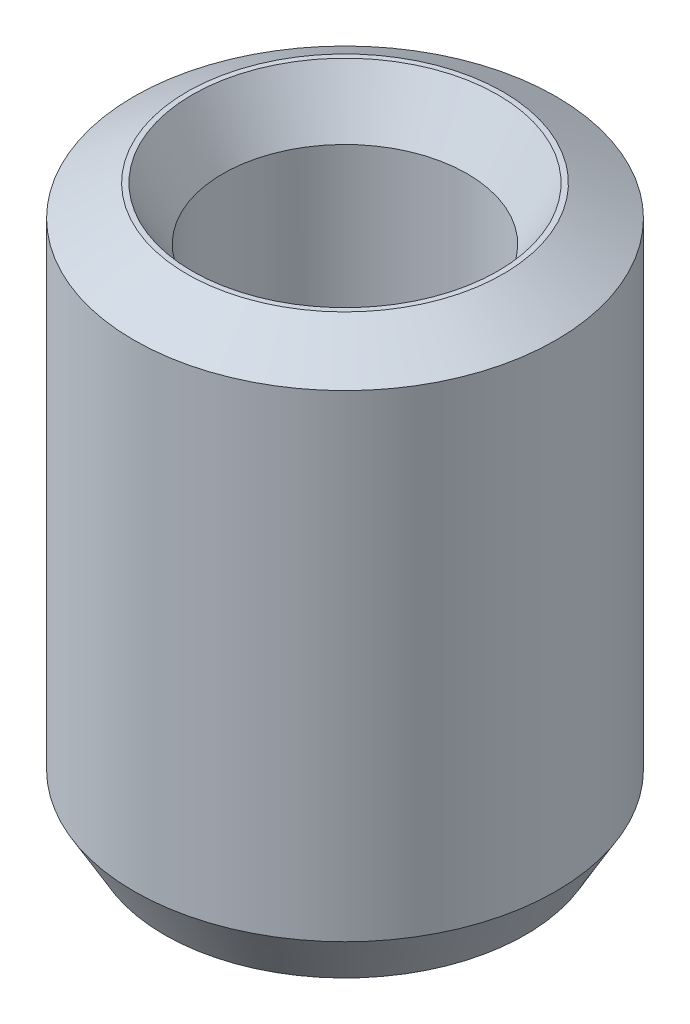
ISO-10303-21;
HEADER;
FILE_DESCRIPTION(('STEP AP214'),'2;1');
FILE_NAME('part.step','',(''),(''),'','','');
FILE_SCHEMA(('AUTOMOTIVE_DESIGN { 1 0 10303 214 1 1 1 1 }'));
ENDSEC;
DATA;
#1=APPLICATION_CONTEXT('core data for automotive mechanical design processes');
#2=APPLICATION_PROTOCOL_DEFINITION('international standard','automotive_design',2000,#1);
#3=PRODUCT_CONTEXT('',#1,'mechanical');
#4=PRODUCT('Part','Part','',(#3));
#5=PRODUCT_RELATED_PRODUCT_CATEGORY('part','',(#4));
#6=PRODUCT_DEFINITION_FORMATION('','',#4);
#7=PRODUCT_DEFINITION_CONTEXT('part definition',#1,'design');
#8=PRODUCT_DEFINITION('design','',#6,#7);
#9=PRODUCT_DEFINITION_SHAPE('','',#8);
#10=(LENGTH_UNIT() NAMED_UNIT(*) SI_UNIT(.MILLI.,.METRE.));
#11=(NAMED_UNIT(*) PLANE_ANGLE_UNIT() SI_UNIT($,.RADIAN.));
#12=(NAMED_UNIT(*) SI_UNIT($,.STERADIAN.) SOLID_ANGLE_UNIT());
#13=UNCERTAINTY_MEASURE_WITH_UNIT(LENGTH_MEASURE(1.E-05),#10,'distance_accuracy_value','');
#14=(GEOMETRIC_REPRESENTATION_CONTEXT(3) GLOBAL_UNCERTAINTY_ASSIGNED_CONTEXT((#13)) GLOBAL_UNIT_ASSIGNED_CONTEXT((#10,
#11,#12)) REPRESENTATION_CONTEXT('',''));
#15=CARTESIAN_POINT('',(0.,0.,0.));
#16=DIRECTION('',(0.,0.,1.));
#17=DIRECTION('',(1.,0.,0.));
#18=AXIS2_PLACEMENT_3D('',#15,#16,#17);
#19=CARTESIAN_POINT('',(0.,59.8108777179771,0.));
#20=DIRECTION('',(0.,-1.,0.));
#21=DIRECTION('',(0.,0.,-1.));
#22=AXIS2_PLACEMENT_3D('',#19,#20,#21);
#23=CYLINDRICAL_SURFACE('',#22,22.5);
#24=CARTESIAN_POINT('',(0.,5.65658224908677,0.));
#25=DIRECTION('',(0.,1.,0.));
#26=DIRECTION('',(0.,0.,1.));
#27=AXIS2_PLACEMENT_3D('',#24,#25,#26);
#28=CIRCLE('',#27,22.5);
#29=CARTESIAN_POINT('',(0.,5.65658224908676,-22.5));
#30=VERTEX_POINT('',#29);
#31=EDGE_CURVE('E10',#30,#30,#28,.T.);
#32=CARTESIAN_POINT('',(0.,56.5450484337736,0.));
#33=DIRECTION('',(0.,1.,0.));
#34=DIRECTION('',(0.,0.,1.));
#35=AXIS2_PLACEMENT_3D('',#32,#33,#34);
#36=CIRCLE('',#35,22.5);
#37=CARTESIAN_POINT('',(0.,56.5450484337736,-22.5));
#38=VERTEX_POINT('',#37);
#39=EDGE_CURVE('E50',#38,#38,#36,.F.);
#40=CARTESIAN_POINT('',(0.,5.65658224908676,-22.5));
#41=CARTESIAN_POINT('',(0.,6.18667043851058,-22.5));
#42=CARTESIAN_POINT('',(0.,6.7167586279344,-22.5));
#43=CARTESIAN_POINT('',(0.,7.77693500678205,-22.5));
#44=CARTESIAN_POINT('',(0.,8.30702319620587,-22.5));
#45=CARTESIAN_POINT('',(0.,9.36719957505351,-22.5));
#46=CARTESIAN_POINT('',(0.,9.89728776447733,-22.5));
#47=CARTESIAN_POINT('',(0.,10.957464143325,-22.5));
#48=CARTESIAN_POINT('',(0.,11.4875523327488,-22.5));
#49=CARTESIAN_POINT('',(0.,12.5477287115964,-22.5));
#50=CARTESIAN_POINT('',(0.,13.0778169010203,-22.5));
#51=CARTESIAN_POINT('',(0.,14.1379932798679,-22.5));
#52=CARTESIAN_POINT('',(0.,14.6680814692917,-22.5));
#53=CARTESIAN_POINT('',(0.,15.7282578481394,-22.5));
#54=CARTESIAN_POINT('',(0.,16.2583460375632,-22.5));
#55=CARTESIAN_POINT('',(0.,17.3185224164108,-22.5));
#56=CARTESIAN_POINT('',(0.,17.8486106058347,-22.5));
#57=CARTESIAN_POINT('',(0.,18.9087869846823,-22.5));
#58=CARTESIAN_POINT('',(0.,19.4388751741061,-22.5));
#59=CARTESIAN_POINT('',(0.,20.4990515529538,-22.5));
#60=CARTESIAN_POINT('',(0.,21.0291397423776,-22.5));
#61=CARTESIAN_POINT('',(0.,22.0893161212252,-22.5));
#62=CARTESIAN_POINT('',(0.,22.619404310649,-22.5));
#63=CARTESIAN_POINT('',(0.,23.6795806894967,-22.5));
#64=CARTESIAN_POINT('',(0.,24.2096688789205,-22.5));
#65=CARTESIAN_POINT('',(0.,25.2698452577682,-22.5));
#66=CARTESIAN_POINT('',(0.,25.799933447192,-22.5));
#67=CARTESIAN_POINT('',(0.,26.8601098260396,-22.5));
#68=CARTESIAN_POINT('',(0.,27.3901980154634,-22.5));
#69=CARTESIAN_POINT('',(0.,28.4503743943111,-22.5));
#70=CARTESIAN_POINT('',(0.,28.9804625837349,-22.5));
#71=CARTESIAN_POINT('',(0.,30.0406389625825,-22.5));
#72=CARTESIAN_POINT('',(0.,30.5707271520064,-22.5));
#73=CARTESIAN_POINT('',(0.,31.630903530854,-22.5));
#74=CARTESIAN_POINT('',(0.,32.1609917202778,-22.5));
#75=CARTESIAN_POINT('',(0.,33.2211680991255,-22.5));
#76=CARTESIAN_POINT('',(0.,33.7512562885493,-22.5));
#77=CARTESIAN_POINT('',(0.,34.8114326673969,-22.5));
#78=CARTESIAN_POINT('',(0.,35.3415208568208,-22.5));
#79=CARTESIAN_POINT('',(0.,36.4016972356684,-22.5));
#80=CARTESIAN_POINT('',(0.,36.9317854250922,-22.5));
#81=CARTESIAN_POINT('',(0.,37.9919618039399,-22.5));
#82=CARTESIAN_POINT('',(0.,38.5220499933637,-22.5));
#83=CARTESIAN_POINT('',(0.,39.5822263722113,-22.5));
#84=CARTESIAN_POINT('',(0.,40.1123145616352,-22.5));
#85=CARTESIAN_POINT('',(0.,41.1724909404828,-22.5));
#86=CARTESIAN_POINT('',(0.,41.7025791299066,-22.5));
#87=CARTESIAN_POINT('',(0.,42.7627555087543,-22.5));
#88=CARTESIAN_POINT('',(0.,43.2928436981781,-22.5));
#89=CARTESIAN_POINT('',(0.,44.3530200770257,-22.5));
#90=CARTESIAN_POINT('',(0.,44.8831082664495,-22.5));
#91=CARTESIAN_POINT('',(0.,45.9432846452972,-22.5));
#92=CARTESIAN_POINT('',(0.,46.473372834721,-22.5));
#93=CARTESIAN_POINT('',(0.,47.5335492135687,-22.5));
#94=CARTESIAN_POINT('',(0.,48.0636374029925,-22.5));
#95=CARTESIAN_POINT('',(0.,49.1238137818401,-22.5));
#96=CARTESIAN_POINT('',(0.,49.6539019712639,-22.5));
#97=CARTESIAN_POINT('',(0.,50.7140783501116,-22.5));
#98=CARTESIAN_POINT('',(0.,51.2441665395354,-22.5));
#99=CARTESIAN_POINT('',(0.,52.304342918383,-22.5));
#100=CARTESIAN_POINT('',(0.,52.8344311078069,-22.5));
#101=CARTESIAN_POINT('',(0.,53.8946074866545,-22.5));
#102=CARTESIAN_POINT('',(0.,54.4246956760783,-22.5));
#103=CARTESIAN_POINT('',(0.,55.484872054926,-22.5));
#104=CARTESIAN_POINT('',(0.,56.0149602443498,-22.5));
#105=CARTESIAN_POINT('',(0.,56.5450484337736,-22.5));
#106=B_SPLINE_CURVE_WITH_KNOTS('',3,(#40,#41,#42,#43,#44,#45,#46,#47,#48,#49,#50,#51,#52,#53,
#54,#55,#56,#57,#58,#59,#60,#61,#62,#63,#64,#65,#66,#67,#68,#69,#70,#71,#72,#73,#74,#75,#76,#77,
#78,#79,#80,#81,#82,#83,#84,#85,#86,#87,#88,#89,#90,#91,#92,#93,#94,#95,#96,#97,#98,#99,#100,
#101,#102,#103,#104,#105),.UNSPECIFIED.,.F.,.F.,(4,2,2,2,2,2,2,2,2,2,2,2,2,2,2,2,2,2,2,2,2,2,2,
2,2,2,2,2,2,2,2,2,4),(0.,1.59026456827147,3.18052913654293,4.7707937048144,6.36105827308586,
7.95132284135733,9.54158740962879,11.1318519779003,12.7221165461717,14.3123811144432,
15.9026456827146,17.4929102509861,19.0831748192576,20.673439387529,22.2637039558005,
23.853968524072,25.4442330923434,27.0344976606149,28.6247622288864,30.2150267971578,
31.8052913654293,33.3955559337007,34.9858205019722,36.5760850702437,38.1663496385151,
39.7566142067866,41.3468787750581,42.9371433433295,44.527407911601,46.1176724798725,
47.7079370481439,49.2982016164154,50.8884661846869),.UNSPECIFIED.);
#107=EDGE_CURVE('BSEAM39',#30,#38,#106,.T.);
#108=ORIENTED_EDGE('',*,*,#31,.T.);
#109=ORIENTED_EDGE('',*,*,#39,.T.);
#110=ORIENTED_EDGE('',*,*,#107,.T.);
#111=ORIENTED_EDGE('',*,*,#107,.F.);
#112=EDGE_LOOP('',(#108,#110,#109,#111));
#113=FACE_BOUND('',#112,.T.);
#114=ADVANCED_FACE('F39',(#113),#23,.T.);
#115=CARTESIAN_POINT('',(0.,59.8108777179771,0.));
#116=DIRECTION('',(0.,1.,0.));
#117=DIRECTION('',(0.,0.,1.));
#118=AXIS2_PLACEMENT_3D('',#115,#116,#117);
#119=PLANE('',#118);
#120=CARTESIAN_POINT('',(0.,59.8108777179771,0.));
#121=DIRECTION('',(0.,1.,0.));
#122=DIRECTION('',(0.,0.,1.));
#123=AXIS2_PLACEMENT_3D('',#120,#121,#122);
#124=CIRCLE('',#123,16.290261178427);
#125=CARTESIAN_POINT('',(0.,59.8108777179771,16.290261178427));
#126=VERTEX_POINT('',#125);
#127=EDGE_CURVE('E58',#126,#126,#124,.F.);
#128=ORIENTED_EDGE('',*,*,#127,.T.);
#129=EDGE_LOOP('',(#128));
#130=FACE_BOUND('',#129,.T.);
#131=CARTESIAN_POINT('',(0.,59.8108777179771,0.));
#132=DIRECTION('',(0.,1.,0.));
#133=DIRECTION('',(0.,0.,1.));
#134=AXIS2_PLACEMENT_3D('',#131,#132,#133);
#135=CIRCLE('',#134,16.8434177509134);
#136=CARTESIAN_POINT('',(0.,59.810877717977,-16.8434177509134));
#137=VERTEX_POINT('',#136);
#138=EDGE_CURVE('E61',#137,#137,#135,.T.);
#139=ORIENTED_EDGE('',*,*,#138,.T.);
#140=EDGE_LOOP('',(#139));
#141=FACE_BOUND('',#140,.T.);
#142=ADVANCED_FACE('F88',(#130,#141),#119,.T.);
#143=CARTESIAN_POINT('',(0.,0.,0.));
#144=DIRECTION('',(0.,1.,0.));
#145=DIRECTION('',(0.,0.,1.));
#146=AXIS2_PLACEMENT_3D('',#143,#144,#145);
#147=PLANE('',#146);
#148=CARTESIAN_POINT('',(0.,0.,0.));
#149=DIRECTION('',(0.,1.,0.));
#150=DIRECTION('',(0.,0.,1.));
#151=AXIS2_PLACEMENT_3D('',#148,#149,#150);
#152=CIRCLE('',#151,18.6810141433101);
#153=CARTESIAN_POINT('',(0.,0.,18.6810141433101));
#154=VERTEX_POINT('',#153);
#155=EDGE_CURVE('E51',#154,#154,#152,.T.);
#156=ORIENTED_EDGE('',*,*,#155,.T.);
#157=EDGE_LOOP('',(#156));
#158=FACE_BOUND('',#157,.T.);
#159=CARTESIAN_POINT('',(0.,0.,0.));
#160=DIRECTION('',(0.,1.,0.));
#161=DIRECTION('',(0.,0.,1.));
#162=AXIS2_PLACEMENT_3D('',#159,#160,#161);
#163=CIRCLE('',#162,19.2341707157965);
#164=CARTESIAN_POINT('',(0.,0.,19.2341707157965));
#165=VERTEX_POINT('',#164);
#166=EDGE_CURVE('E54',#165,#165,#163,.F.);
#167=ORIENTED_EDGE('',*,*,#166,.T.);
#168=EDGE_LOOP('',(#167));
#169=FACE_BOUND('',#168,.T.);
#170=ADVANCED_FACE('F83',(#158,#169),#147,.F.);
#171=CARTESIAN_POINT('',(0.,59.8108777179771,0.));
#172=DIRECTION('',(0.,-1.,0.));
#173=DIRECTION('',(0.,0.,-1.));
#174=AXIS2_PLACEMENT_3D('',#171,#172,#173);
#175=CYLINDRICAL_SURFACE('',#174,13.0244318942235);
#176=CARTESIAN_POINT('',(0.,54.1542954688903,0.));
#177=DIRECTION('',(0.,1.,0.));
#178=DIRECTION('',(0.,0.,1.));
#179=AXIS2_PLACEMENT_3D('',#176,#177,#178);
#180=CIRCLE('',#179,13.0244318942235);
#181=CARTESIAN_POINT('',(0.,54.1542954688903,-13.0244318942235));
#182=VERTEX_POINT('',#181);
#183=EDGE_CURVE('E67',#182,#182,#180,.T.);
#184=CARTESIAN_POINT('',(0.,3.26582928420344,0.));
#185=DIRECTION('',(0.,1.,0.));
#186=DIRECTION('',(0.,0.,1.));
#187=AXIS2_PLACEMENT_3D('',#184,#185,#186);
#188=CIRCLE('',#187,13.0244318942235);
#189=CARTESIAN_POINT('',(0.,3.26582928420344,-13.0244318942235));
#190=VERTEX_POINT('',#189);
#191=EDGE_CURVE('E69',#190,#190,#188,.F.);
#192=CARTESIAN_POINT('',(0.,54.1542954688903,-13.0244318942235));
#193=CARTESIAN_POINT('',(0.,53.6242072794665,-13.0244318942235));
#194=CARTESIAN_POINT('',(0.,53.0941190900427,-13.0244318942235));
#195=CARTESIAN_POINT('',(0.,52.033942711195,-13.0244318942235));
#196=CARTESIAN_POINT('',(0.,51.5038545217712,-13.0244318942235));
#197=CARTESIAN_POINT('',(0.,50.4436781429236,-13.0244318942235));
#198=CARTESIAN_POINT('',(0.,49.9135899534997,-13.0244318942235));
#199=CARTESIAN_POINT('',(0.,48.8534135746521,-13.0244318942235));
#200=CARTESIAN_POINT('',(0.,48.3233253852283,-13.0244318942235));
#201=CARTESIAN_POINT('',(0.,47.2631490063806,-13.0244318942235));
#202=CARTESIAN_POINT('',(0.,46.7330608169568,-13.0244318942235));
#203=CARTESIAN_POINT('',(0.,45.6728844381092,-13.0244318942235));
#204=CARTESIAN_POINT('',(0.,45.1427962486853,-13.0244318942235));
#205=CARTESIAN_POINT('',(0.,44.0826198698377,-13.0244318942235));
#206=CARTESIAN_POINT('',(0.,43.5525316804139,-13.0244318942235));
#207=CARTESIAN_POINT('',(0.,42.4923553015662,-13.0244318942235));
#208=CARTESIAN_POINT('',(0.,41.9622671121424,-13.0244318942235));
#209=CARTESIAN_POINT('',(0.,40.9020907332948,-13.0244318942235));
#210=CARTESIAN_POINT('',(0.,40.3720025438709,-13.0244318942235));
#211=CARTESIAN_POINT('',(0.,39.3118261650233,-13.0244318942235));
#212=CARTESIAN_POINT('',(0.,38.7817379755995,-13.0244318942235));
#213=CARTESIAN_POINT('',(0.,37.7215615967518,-13.0244318942235));
#214=CARTESIAN_POINT('',(0.,37.191473407328,-13.0244318942235));
#215=CARTESIAN_POINT('',(0.,36.1312970284804,-13.0244318942235));
#216=CARTESIAN_POINT('',(0.,35.6012088390566,-13.0244318942235));
#217=CARTESIAN_POINT('',(0.,34.5410324602089,-13.0244318942235));
#218=CARTESIAN_POINT('',(0.,34.0109442707851,-13.0244318942235));
#219=CARTESIAN_POINT('',(0.,32.9507678919374,-13.0244318942235));
#220=CARTESIAN_POINT('',(0.,32.4206797025136,-13.0244318942235));
#221=CARTESIAN_POINT('',(0.,31.360503323666,-13.0244318942235));
#222=CARTESIAN_POINT('',(0.,30.8304151342422,-13.0244318942235));
#223=CARTESIAN_POINT('',(0.,29.7702387553945,-13.0244318942235));
#224=CARTESIAN_POINT('',(0.,29.2401505659707,-13.0244318942235));
#225=CARTESIAN_POINT('',(0.,28.179974187123,-13.0244318942235));
#226=CARTESIAN_POINT('',(0.,27.6498859976992,-13.0244318942235));
#227=CARTESIAN_POINT('',(0.,26.5897096188516,-13.0244318942235));
#228=CARTESIAN_POINT('',(0.,26.0596214294278,-13.0244318942235));
#229=CARTESIAN_POINT('',(0.,24.9994450505801,-13.0244318942235));
#230=CARTESIAN_POINT('',(0.,24.4693568611563,-13.0244318942235));
#231=CARTESIAN_POINT('',(0.,23.4091804823087,-13.0244318942235));
#232=CARTESIAN_POINT('',(0.,22.8790922928848,-13.0244318942235));
#233=CARTESIAN_POINT('',(0.,21.8189159140372,-13.0244318942235));
#234=CARTESIAN_POINT('',(0.,21.2888277246134,-13.0244318942235));
#235=CARTESIAN_POINT('',(0.,20.2286513457657,-13.0244318942235));
#236=CARTESIAN_POINT('',(0.,19.6985631563419,-13.0244318942235));
#237=CARTESIAN_POINT('',(0.,18.6383867774943,-13.0244318942235));
#238=CARTESIAN_POINT('',(0.,18.1082985880704,-13.0244318942235));
#239=CARTESIAN_POINT('',(0.,17.0481222092228,-13.0244318942235));
#240=CARTESIAN_POINT('',(0.,16.518034019799,-13.0244318942235));
#241=CARTESIAN_POINT('',(0.,15.4578576409513,-13.0244318942235));
#242=CARTESIAN_POINT('',(0.,14.9277694515275,-13.0244318942235));
#243=CARTESIAN_POINT('',(0.,13.8675930726799,-13.0244318942235));
#244=CARTESIAN_POINT('',(0.,13.337504883256,-13.0244318942235));
#245=CARTESIAN_POINT('',(0.,12.2773285044084,-13.0244318942235));
#246=CARTESIAN_POINT('',(0.,11.7472403149846,-13.0244318942235));
#247=CARTESIAN_POINT('',(0.,10.6870639361369,-13.0244318942235));
#248=CARTESIAN_POINT('',(0.,10.1569757467131,-13.0244318942235));
#249=CARTESIAN_POINT('',(0.,9.09679936786548,-13.0244318942235));
#250=CARTESIAN_POINT('',(0.,8.56671117844165,-13.0244318942235));
#251=CARTESIAN_POINT('',(0.,7.50653479959401,-13.0244318942235));
#252=CARTESIAN_POINT('',(0.,6.97644661017019,-13.0244318942235));
#253=CARTESIAN_POINT('',(0.,5.91627023132255,-13.0244318942235));
#254=CARTESIAN_POINT('',(0.,5.38618204189872,-13.0244318942235));
#255=CARTESIAN_POINT('',(0.,4.32600566305108,-13.0244318942235));
#256=CARTESIAN_POINT('',(0.,3.79591747362726,-13.0244318942235));
#257=CARTESIAN_POINT('',(0.,3.26582928420344,-13.0244318942235));
#258=B_SPLINE_CURVE_WITH_KNOTS('',3,(#192,#193,#194,#195,#196,#197,#198,#199,#200,#201,#202,
#203,#204,#205,#206,#207,#208,#209,#210,#211,#212,#213,#214,#215,#216,#217,#218,#219,#220,#221,
#222,#223,#224,#225,#226,#227,#228,#229,#230,#231,#232,#233,#234,#235,#236,#237,#238,#239,#240,
#241,#242,#243,#244,#245,#246,#247,#248,#249,#250,#251,#252,#253,#254,#255,#256,#257),
.UNSPECIFIED.,.F.,.F.,(4,2,2,2,2,2,2,2,2,2,2,2,2,2,2,2,2,2,2,2,2,2,2,2,2,2,2,2,2,2,2,2,4),(0.,
1.59026456827146,3.18052913654292,4.77079370481439,6.36105827308586,7.95132284135732,
9.54158740962879,11.1318519779003,12.7221165461717,14.3123811144432,15.9026456827146,
17.4929102509861,19.0831748192576,20.673439387529,22.2637039558005,23.853968524072,
25.4442330923434,27.0344976606149,28.6247622288864,30.2150267971578,31.8052913654293,
33.3955559337007,34.9858205019722,36.5760850702437,38.1663496385151,39.7566142067866,
41.3468787750581,42.9371433433295,44.527407911601,46.1176724798725,47.7079370481439,
49.2982016164154,50.8884661846869),.UNSPECIFIED.);
#259=EDGE_CURVE('BSEAM71',#182,#190,#258,.T.);
#260=ORIENTED_EDGE('',*,*,#183,.T.);
#261=ORIENTED_EDGE('',*,*,#191,.T.);
#262=ORIENTED_EDGE('',*,*,#259,.T.);
#263=ORIENTED_EDGE('',*,*,#259,.F.);
#264=EDGE_LOOP('',(#260,#262,#261,#263));
#265=FACE_BOUND('',#264,.T.);
#266=ADVANCED_FACE('F71',(#265),#175,.F.);
#267=CARTESIAN_POINT('',(0.,54.1542954688903,0.));
#268=DIRECTION('',(0.,1.,0.));
#269=DIRECTION('',(0.,0.,1.));
#270=AXIS2_PLACEMENT_3D('',#267,#268,#269);
#271=CONICAL_SURFACE('',#270,13.0244318942235,0.523598775598302);
#272=ORIENTED_EDGE('',*,*,#127,.F.);
#273=EDGE_LOOP('',(#272));
#274=FACE_BOUND('',#273,.T.);
#275=ORIENTED_EDGE('',*,*,#183,.F.);
#276=EDGE_LOOP('',(#275));
#277=FACE_BOUND('',#276,.T.);
#278=ADVANCED_FACE('F77',(#274,#277),#271,.F.);
#279=CARTESIAN_POINT('',(0.,0.,0.));
#280=DIRECTION('',(0.,-1.,0.));
#281=DIRECTION('',(0.,0.,-1.));
#282=AXIS2_PLACEMENT_3D('',#279,#280,#281);
#283=CONICAL_SURFACE('',#282,18.6810141433101,1.04719755119659);
#284=ORIENTED_EDGE('',*,*,#191,.F.);
#285=EDGE_LOOP('',(#284));
#286=FACE_BOUND('',#285,.T.);
#287=ORIENTED_EDGE('',*,*,#155,.F.);
#288=EDGE_LOOP('',(#287));
#289=FACE_BOUND('',#288,.T.);
#290=ADVANCED_FACE('F73',(#286,#289),#283,.F.);
#291=CARTESIAN_POINT('',(0.,5.65658224908677,0.));
#292=DIRECTION('',(0.,1.,0.));
#293=DIRECTION('',(0.,0.,1.));
#294=AXIS2_PLACEMENT_3D('',#291,#292,#293);
#295=CONICAL_SURFACE('',#294,22.5,0.523598775598303);
#296=ORIENTED_EDGE('',*,*,#166,.F.);
#297=EDGE_LOOP('',(#296));
#298=FACE_BOUND('',#297,.T.);
#299=ORIENTED_EDGE('',*,*,#31,.F.);
#300=EDGE_LOOP('',(#299));
#301=FACE_BOUND('',#300,.T.);
#302=ADVANCED_FACE('F76',(#298,#301),#295,.T.);
#303=CARTESIAN_POINT('',(0.,59.8108777179771,0.));
#304=DIRECTION('',(0.,-1.,0.));
#305=DIRECTION('',(0.,0.,-1.));
#306=AXIS2_PLACEMENT_3D('',#303,#304,#305);
#307=CONICAL_SURFACE('',#306,16.8434177509134,1.04719755119659);
#308=CARTESIAN_POINT('',(0.,56.5450484337736,-22.5));
#309=CARTESIAN_POINT('',(0.,56.5790674888174,-22.4410772682387));
#310=CARTESIAN_POINT('',(0.,56.6130865438612,-22.3821545364774));
#311=CARTESIAN_POINT('',(0.,56.6811246539488,-22.2643090729547));
#312=CARTESIAN_POINT('',(0.,56.7151437089926,-22.2053863411934));
#313=CARTESIAN_POINT('',(0.,56.7831818190801,-22.0875408776708));
#314=CARTESIAN_POINT('',(0.,56.8172008741239,-22.0286181459095));
#315=CARTESIAN_POINT('',(0.,56.8852389842115,-21.9107726823868));
#316=CARTESIAN_POINT('',(0.,56.9192580392553,-21.8518499506255));
#317=CARTESIAN_POINT('',(0.,56.9872961493428,-21.7340044871029));
#318=CARTESIAN_POINT('',(0.,57.0213152043866,-21.6750817553415));
#319=CARTESIAN_POINT('',(0.,57.0893533144742,-21.5572362918189));
#320=CARTESIAN_POINT('',(0.,57.123372369518,-21.4983135600576));
#321=CARTESIAN_POINT('',(0.,57.1914104796056,-21.380468096535));
#322=CARTESIAN_POINT('',(0.,57.2254295346493,-21.3215453647736));
#323=CARTESIAN_POINT('',(0.,57.2934676447369,-21.203699901251));
#324=CARTESIAN_POINT('',(0.,57.3274866997807,-21.1447771694897));
#325=CARTESIAN_POINT('',(0.,57.3955248098683,-21.026931705967));
#326=CARTESIAN_POINT('',(0.,57.429543864912,-20.9680089742057));
#327=CARTESIAN_POINT('',(0.,57.4975819749996,-20.8501635106831));
#328=CARTESIAN_POINT('',(0.,57.5316010300434,-20.7912407789218));
#329=CARTESIAN_POINT('',(0.,57.599639140131,-20.6733953153991));
#330=CARTESIAN_POINT('',(0.,57.6336581951748,-20.6144725836378));
#331=CARTESIAN_POINT('',(0.,57.7016963052623,-20.4966271201152));
#332=CARTESIAN_POINT('',(0.,57.7357153603061,-20.4377043883539));
#333=CARTESIAN_POINT('',(0.,57.8037534703937,-20.3198589248312));
#334=CARTESIAN_POINT('',(0.,57.8377725254375,-20.2609361930699));
#335=CARTESIAN_POINT('',(0.,57.9058106355251,-20.1430907295473));
#336=CARTESIAN_POINT('',(0.,57.9398296905688,-20.0841679977859));
#337=CARTESIAN_POINT('',(0.,58.0078678006564,-19.9663225342633));
#338=CARTESIAN_POINT('',(0.,58.0418868557002,-19.907399802502));
#339=CARTESIAN_POINT('',(0.,58.1099249657878,-19.7895543389794));
#340=CARTESIAN_POINT('',(0.,58.1439440208316,-19.730631607218));
#341=CARTESIAN_POINT('',(0.,58.2119821309191,-19.6127861436954));
#342=CARTESIAN_POINT('',(0.,58.2460011859629,-19.5538634119341));
#343=CARTESIAN_POINT('',(0.,58.3140392960505,-19.4360179484114));
#344=CARTESIAN_POINT('',(0.,58.3480583510943,-19.3770952166501));
#345=CARTESIAN_POINT('',(0.,58.4160964611818,-19.2592497531275));
#346=CARTESIAN_POINT('',(0.,58.4501155162256,-19.2003270213662));
#347=CARTESIAN_POINT('',(0.,58.5181536263132,-19.0824815578435));
#348=CARTESIAN_POINT('',(0.,58.552172681357,-19.0235588260822));
#349=CARTESIAN_POINT('',(0.,58.6202107914446,-18.9057133625596));
#350=CARTESIAN_POINT('',(0.,58.6542298464883,-18.8467906307983));
#351=CARTESIAN_POINT('',(0.,58.7222679565759,-18.7289451672756));
#352=CARTESIAN_POINT('',(0.,58.7562870116197,-18.6700224355143));
#353=CARTESIAN_POINT('',(0.,58.8243251217073,-18.5521769719917));
#354=CARTESIAN_POINT('',(0.,58.8583441767511,-18.4932542402303));
#355=CARTESIAN_POINT('',(0.,58.9263822868386,-18.3754087767077));
#356=CARTESIAN_POINT('',(0.,58.9604013418824,-18.3164860449464));
#357=CARTESIAN_POINT('',(0.,59.02843945197,-18.1986405814237));
#358=CARTESIAN_POINT('',(0.,59.0624585070138,-18.1397178496624));
#359=CARTESIAN_POINT('',(0.,59.1304966171013,-18.0218723861398));
#360=CARTESIAN_POINT('',(0.,59.1645156721451,-17.9629496543785));
#361=CARTESIAN_POINT('',(0.,59.2325537822327,-17.8451041908558));
#362=CARTESIAN_POINT('',(0.,59.2665728372765,-17.7861814590945));
#363=CARTESIAN_POINT('',(0.,59.334610947364,-17.6683359955719));
#364=CARTESIAN_POINT('',(0.,59.3686300024078,-17.6094132638106));
#365=CARTESIAN_POINT('',(0.,59.4366681124954,-17.4915678002879));
#366=CARTESIAN_POINT('',(0.,59.4706871675392,-17.4326450685266));
#367=CARTESIAN_POINT('',(0.,59.5387252776268,-17.314799605004));
#368=CARTESIAN_POINT('',(0.,59.5727443326706,-17.2558768732426));
#369=CARTESIAN_POINT('',(0.,59.6407824427581,-17.13803140972));
#370=CARTESIAN_POINT('',(0.,59.6748014978019,-17.0791086779587));
#371=CARTESIAN_POINT('',(0.,59.7428396078895,-16.9612632144361));
#372=CARTESIAN_POINT('',(0.,59.7768586629333,-16.9023404826747));
#373=CARTESIAN_POINT('',(0.,59.8108777179771,-16.8434177509134));
#374=B_SPLINE_CURVE_WITH_KNOTS('',3,(#308,#309,#310,#311,#312,#313,#314,#315,#316,#317,#318,
#319,#320,#321,#322,#323,#324,#325,#326,#327,#328,#329,#330,#331,#332,#333,#334,#335,#336,#337,
#338,#339,#340,#341,#342,#343,#344,#345,#346,#347,#348,#349,#350,#351,#352,#353,#354,#355,#356,
#357,#358,#359,#360,#361,#362,#363,#364,#365,#366,#367,#368,#369,#370,#371,#372,#373),
.UNSPECIFIED.,.F.,.F.,(4,2,2,2,2,2,2,2,2,2,2,2,2,2,2,2,2,2,2,2,2,2,2,2,2,2,2,2,2,2,2,2,4),(0.,
0.204114330262716,0.408228660525426,0.612342990788139,0.816457321050851,1.02057165131357,
1.22468598157628,1.42880031183899,1.63291464210171,1.83702897236442,2.04114330262713,
2.24525763288985,2.44937196315256,2.65348629341527,2.85760062367798,3.0617149539407,
3.26582928420341,3.46994361446612,3.67405794472884,3.87817227499155,4.08228660525426,
4.28640093551697,4.49051526577969,4.6946295960424,4.89874392630512,5.10285825656783,
5.30697258683054,5.51108691709326,5.71520124735597,5.91931557761869,6.1234299078814,
6.32754423814411,6.53165856840682),.UNSPECIFIED.);
#375=EDGE_CURVE('BSEAM45',#38,#137,#374,.T.);
#376=ORIENTED_EDGE('',*,*,#39,.F.);
#377=ORIENTED_EDGE('',*,*,#138,.F.);
#378=ORIENTED_EDGE('',*,*,#375,.T.);
#379=ORIENTED_EDGE('',*,*,#375,.F.);
#380=EDGE_LOOP('',(#376,#378,#377,#379));
#381=FACE_BOUND('',#380,.T.);
#382=ADVANCED_FACE('F45',(#381),#307,.T.);
#383=CLOSED_SHELL('',(#114,#142,#170,#266,#278,#290,#302,#382));
#384=MANIFOLD_SOLID_BREP('B2',#383);
#385=ADVANCED_BREP_SHAPE_REPRESENTATION('',(#18,#384),#14);
#386=SHAPE_DEFINITION_REPRESENTATION(#9,#385);
ENDSEC;
END-ISO-10303-21;
